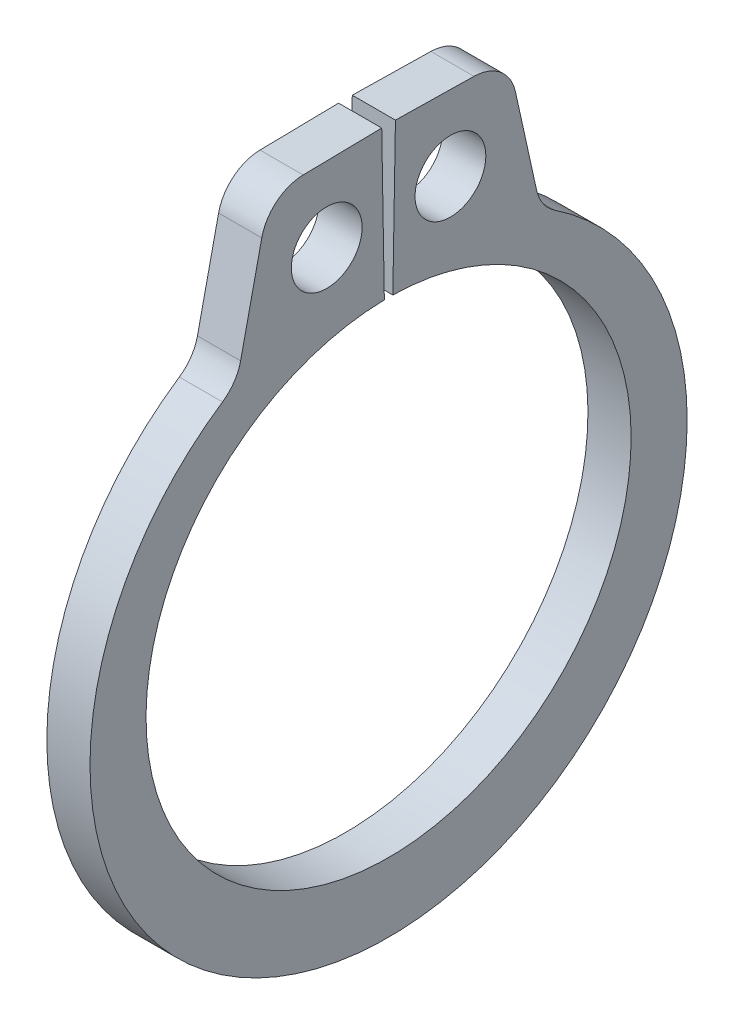
ISO-10303-21;
HEADER;
FILE_DESCRIPTION(('STEP AP214'),'2;1');
FILE_NAME('part.step','',(''),(''),'','','');
FILE_SCHEMA(('AUTOMOTIVE_DESIGN { 1 0 10303 214 1 1 1 1 }'));
ENDSEC;
DATA;
#1=APPLICATION_CONTEXT('core data for automotive mechanical design processes');
#2=APPLICATION_PROTOCOL_DEFINITION('international standard','automotive_design',2000,#1);
#3=PRODUCT_CONTEXT('',#1,'mechanical');
#4=PRODUCT('Part','Part','',(#3));
#5=PRODUCT_RELATED_PRODUCT_CATEGORY('part','',(#4));
#6=PRODUCT_DEFINITION_FORMATION('','',#4);
#7=PRODUCT_DEFINITION_CONTEXT('part definition',#1,'design');
#8=PRODUCT_DEFINITION('design','',#6,#7);
#9=PRODUCT_DEFINITION_SHAPE('','',#8);
#10=(LENGTH_UNIT() NAMED_UNIT(*) SI_UNIT(.MILLI.,.METRE.));
#11=(NAMED_UNIT(*) PLANE_ANGLE_UNIT() SI_UNIT($,.RADIAN.));
#12=(NAMED_UNIT(*) SI_UNIT($,.STERADIAN.) SOLID_ANGLE_UNIT());
#13=UNCERTAINTY_MEASURE_WITH_UNIT(LENGTH_MEASURE(1.E-05),#10,'distance_accuracy_value','');
#14=(GEOMETRIC_REPRESENTATION_CONTEXT(3) GLOBAL_UNCERTAINTY_ASSIGNED_CONTEXT((#13)) GLOBAL_UNIT_ASSIGNED_CONTEXT((#10,
#11,#12)) REPRESENTATION_CONTEXT('',''));
#15=CARTESIAN_POINT('',(0.,0.,0.));
#16=DIRECTION('',(0.,0.,1.));
#17=DIRECTION('',(1.,0.,0.));
#18=AXIS2_PLACEMENT_3D('',#15,#16,#17);
#19=CARTESIAN_POINT('',(0.3175,0.,0.));
#20=DIRECTION('',(1.,0.,0.));
#21=DIRECTION('',(0.,0.,-1.));
#22=AXIS2_PLACEMENT_3D('',#19,#20,#21);
#23=PLANE('',#22);
#24=CARTESIAN_POINT('',(0.3175,4.65842581517849,0.910114355509011));
#25=DIRECTION('',(1.,0.,0.));
#26=DIRECTION('',(0.,0.,-1.));
#27=AXIS2_PLACEMENT_3D('',#24,#25,#26);
#28=CIRCLE('',#27,0.5207);
#29=CARTESIAN_POINT('',(0.3175,4.65842581517849,0.38941435550901));
#30=VERTEX_POINT('',#29);
#31=EDGE_CURVE('E222',#30,#30,#28,.T.);
#32=ORIENTED_EDGE('',*,*,#31,.F.);
#33=EDGE_LOOP('',(#32));
#34=FACE_BOUND('',#33,.T.);
#35=DIRECTION('',(0.,-0.0174524064372835,0.999847695156391));
#36=VECTOR('',#35,1.);
#37=CARTESIAN_POINT('',(0.3175,5.77761990646121,0.100848730597843));
#38=LINE('',#37,#36);
#39=CARTESIAN_POINT('',(0.3175,5.77761990646121,0.100848730597843));
#40=VERTEX_POINT('',#39);
#41=CARTESIAN_POINT('',(0.3175,5.75744047202589,1.25692775512773));
#42=VERTEX_POINT('',#41);
#43=EDGE_CURVE('E134',#40,#42,#38,.T.);
#44=ORIENTED_EDGE('',*,*,#43,.T.);
#45=CARTESIAN_POINT('',(0.3175,5.12253718560158,1.24584547704006));
#46=DIRECTION('',(1.,0.,0.));
#47=DIRECTION('',(0.,0.,-1.));
#48=AXIS2_PLACEMENT_3D('',#45,#46,#47);
#49=CIRCLE('',#48,0.635);
#50=CARTESIAN_POINT('',(0.3175,5.25937291445874,1.86592690984395));
#51=VERTEX_POINT('',#50);
#52=EDGE_CURVE('E175',#42,#51,#49,.T.);
#53=ORIENTED_EDGE('',*,*,#52,.T.);
#54=DIRECTION('',(0.,-0.976506193391958,0.215489336782934));
#55=VECTOR('',#54,1.);
#56=CARTESIAN_POINT('',(0.3175,5.74869516065237,1.75794630816529));
#57=LINE('',#56,#55);
#58=CARTESIAN_POINT('',(0.3175,3.84966926127579,2.17701157816509));
#59=VERTEX_POINT('',#58);
#60=EDGE_CURVE('E214',#51,#59,#57,.T.);
#61=ORIENTED_EDGE('',*,*,#60,.T.);
#62=CARTESIAN_POINT('',(0.3175,3.98650499013295,2.79709301096898));
#63=DIRECTION('',(1.,0.,0.));
#64=DIRECTION('',(0.,0.,-1.));
#65=AXIS2_PLACEMENT_3D('',#62,#63,#64);
#66=CIRCLE('',#65,0.635);
#67=CARTESIAN_POINT('',(0.3175,3.45883224612625,2.44384171906414));
#68=VERTEX_POINT('',#67);
#69=EDGE_CURVE('E182',#59,#68,#66,.F.);
#70=ORIENTED_EDGE('',*,*,#69,.T.);
#71=CARTESIAN_POINT('',(0.3175,-0.191681411907309,0.));
#72=DIRECTION('',(1.,0.,0.));
#73=DIRECTION('',(0.,0.,-1.));
#74=AXIS2_PLACEMENT_3D('',#71,#72,#73);
#75=CIRCLE('',#74,4.39301858809269);
#76=CARTESIAN_POINT('',(0.3175,3.45883224612625,-2.44384171906414));
#77=VERTEX_POINT('',#76);
#78=EDGE_CURVE('E207',#68,#77,#75,.T.);
#79=ORIENTED_EDGE('',*,*,#78,.T.);
#80=CARTESIAN_POINT('',(0.3175,3.98650499013295,-2.79709301096898));
#81=DIRECTION('',(1.,0.,0.));
#82=DIRECTION('',(0.,0.,-1.));
#83=AXIS2_PLACEMENT_3D('',#80,#81,#82);
#84=CIRCLE('',#83,0.635);
#85=CARTESIAN_POINT('',(0.3175,3.84966926127579,-2.17701157816509));
#86=VERTEX_POINT('',#85);
#87=EDGE_CURVE('E11',#77,#86,#84,.F.);
#88=ORIENTED_EDGE('',*,*,#87,.T.);
#89=DIRECTION('',(0.,0.976506193391958,0.215489336782934));
#90=VECTOR('',#89,1.);
#91=CARTESIAN_POINT('',(0.3175,5.74869516065237,-1.75794630816529));
#92=LINE('',#91,#90);
#93=CARTESIAN_POINT('',(0.3175,5.25937291445874,-1.86592690984395));
#94=VERTEX_POINT('',#93);
#95=EDGE_CURVE('E206',#86,#94,#92,.T.);
#96=ORIENTED_EDGE('',*,*,#95,.T.);
#97=CARTESIAN_POINT('',(0.3175,5.12253718560158,-1.24584547704006));
#98=DIRECTION('',(1.,0.,0.));
#99=DIRECTION('',(0.,0.,-1.));
#100=AXIS2_PLACEMENT_3D('',#97,#98,#99);
#101=CIRCLE('',#100,0.635);
#102=CARTESIAN_POINT('',(0.3175,5.75744047202589,-1.25692775512773));
#103=VERTEX_POINT('',#102);
#104=EDGE_CURVE('E50',#94,#103,#101,.T.);
#105=ORIENTED_EDGE('',*,*,#104,.T.);
#106=DIRECTION('',(0.,0.017452406437284,0.999847695156391));
#107=VECTOR('',#106,1.);
#108=CARTESIAN_POINT('',(0.3175,5.77761990646121,-0.100848730597843));
#109=LINE('',#108,#107);
#110=CARTESIAN_POINT('',(0.3175,5.77761990646121,-0.100848730597843));
#111=VERTEX_POINT('',#110);
#112=EDGE_CURVE('E211',#103,#111,#109,.T.);
#113=ORIENTED_EDGE('',*,*,#112,.T.);
#114=DIRECTION('',(0.,-0.999847695156391,0.0174524064372835));
#115=VECTOR('',#114,1.);
#116=CARTESIAN_POINT('',(0.3175,3.56815646970461,-0.0622824028527338));
#117=LINE('',#116,#115);
#118=CARTESIAN_POINT('',(0.3175,3.56815646970461,-0.0622824028527338));
#119=VERTEX_POINT('',#118);
#120=EDGE_CURVE('E140',#111,#119,#117,.T.);
#121=ORIENTED_EDGE('',*,*,#120,.T.);
#122=CARTESIAN_POINT('',(0.3175,0.,0.));
#123=DIRECTION('',(-1.,0.,0.));
#124=DIRECTION('',(0.,0.,-1.));
#125=AXIS2_PLACEMENT_3D('',#122,#123,#124);
#126=CIRCLE('',#125,3.5687);
#127=CARTESIAN_POINT('',(0.3175,3.56815646970461,0.0622824028527338));
#128=VERTEX_POINT('',#127);
#129=EDGE_CURVE('E135',#119,#128,#126,.T.);
#130=ORIENTED_EDGE('',*,*,#129,.T.);
#131=DIRECTION('',(0.,0.999847695156391,0.0174524064372835));
#132=VECTOR('',#131,1.);
#133=CARTESIAN_POINT('',(0.3175,3.56815646970461,0.0622824028527338));
#134=LINE('',#133,#132);
#135=EDGE_CURVE('E126',#128,#40,#134,.T.);
#136=ORIENTED_EDGE('',*,*,#135,.T.);
#137=EDGE_LOOP('',(#44,#53,#61,#70,#79,#88,#96,#105,#113,#121,#130,#136));
#138=FACE_BOUND('',#137,.T.);
#139=CARTESIAN_POINT('',(0.3175,4.65842581517849,-0.910114355509011));
#140=DIRECTION('',(1.,0.,0.));
#141=DIRECTION('',(0.,0.,-1.));
#142=AXIS2_PLACEMENT_3D('',#139,#140,#141);
#143=CIRCLE('',#142,0.5207);
#144=CARTESIAN_POINT('',(0.3175,4.65842581517849,-1.43081435550901));
#145=VERTEX_POINT('',#144);
#146=EDGE_CURVE('E248',#145,#145,#143,.T.);
#147=ORIENTED_EDGE('',*,*,#146,.F.);
#148=EDGE_LOOP('',(#147));
#149=FACE_BOUND('',#148,.T.);
#150=ADVANCED_FACE('F35',(#34,#138,#149),#23,.T.);
#151=CARTESIAN_POINT('',(-0.3175,0.,0.));
#152=DIRECTION('',(1.,0.,0.));
#153=DIRECTION('',(0.,0.,-1.));
#154=AXIS2_PLACEMENT_3D('',#151,#152,#153);
#155=PLANE('',#154);
#156=CARTESIAN_POINT('',(-0.3175,4.65842581517849,0.910114355509011));
#157=DIRECTION('',(1.,0.,0.));
#158=DIRECTION('',(0.,0.,-1.));
#159=AXIS2_PLACEMENT_3D('',#156,#157,#158);
#160=CIRCLE('',#159,0.5207);
#161=CARTESIAN_POINT('',(-0.3175,4.65842581517849,0.38941435550901));
#162=VERTEX_POINT('',#161);
#163=EDGE_CURVE('E245',#162,#162,#160,.T.);
#164=ORIENTED_EDGE('',*,*,#163,.T.);
#165=EDGE_LOOP('',(#164));
#166=FACE_BOUND('',#165,.T.);
#167=DIRECTION('',(0.,-0.976506193391958,0.215489336782934));
#168=VECTOR('',#167,1.);
#169=CARTESIAN_POINT('',(-0.3175,5.74869516065237,1.75794630816529));
#170=LINE('',#169,#168);
#171=CARTESIAN_POINT('',(-0.3175,5.25937291445874,1.86592690984395));
#172=VERTEX_POINT('',#171);
#173=CARTESIAN_POINT('',(-0.3175,3.84966926127579,2.17701157816509));
#174=VERTEX_POINT('',#173);
#175=EDGE_CURVE('E201',#172,#174,#170,.T.);
#176=ORIENTED_EDGE('',*,*,#175,.F.);
#177=CARTESIAN_POINT('',(-0.3175,5.12253718560158,1.24584547704006));
#178=DIRECTION('',(1.,0.,0.));
#179=DIRECTION('',(0.,0.,-1.));
#180=AXIS2_PLACEMENT_3D('',#177,#178,#179);
#181=CIRCLE('',#180,0.635);
#182=CARTESIAN_POINT('',(-0.3175,5.75744047202589,1.25692775512773));
#183=VERTEX_POINT('',#182);
#184=EDGE_CURVE('E171',#172,#183,#181,.F.);
#185=ORIENTED_EDGE('',*,*,#184,.T.);
#186=DIRECTION('',(0.,-0.0174524064372835,0.999847695156391));
#187=VECTOR('',#186,1.);
#188=CARTESIAN_POINT('',(-0.3175,5.77761990646121,0.100848730597843));
#189=LINE('',#188,#187);
#190=CARTESIAN_POINT('',(-0.3175,5.77761990646121,0.100848730597843));
#191=VERTEX_POINT('',#190);
#192=EDGE_CURVE('E224',#191,#183,#189,.T.);
#193=ORIENTED_EDGE('',*,*,#192,.F.);
#194=DIRECTION('',(0.,0.999847695156391,0.0174524064372835));
#195=VECTOR('',#194,1.);
#196=CARTESIAN_POINT('',(-0.3175,3.56815646970461,0.0622824028527338));
#197=LINE('',#196,#195);
#198=CARTESIAN_POINT('',(-0.3175,3.56815646970461,0.0622824028527338));
#199=VERTEX_POINT('',#198);
#200=EDGE_CURVE('E221',#199,#191,#197,.T.);
#201=ORIENTED_EDGE('',*,*,#200,.F.);
#202=CARTESIAN_POINT('',(-0.3175,0.,0.));
#203=DIRECTION('',(-1.,0.,0.));
#204=DIRECTION('',(0.,0.,-1.));
#205=AXIS2_PLACEMENT_3D('',#202,#203,#204);
#206=CIRCLE('',#205,3.5687);
#207=CARTESIAN_POINT('',(-0.3175,3.56815646970461,-0.0622824028527338));
#208=VERTEX_POINT('',#207);
#209=EDGE_CURVE('E148',#208,#199,#206,.T.);
#210=ORIENTED_EDGE('',*,*,#209,.F.);
#211=DIRECTION('',(0.,-0.999847695156391,0.0174524064372835));
#212=VECTOR('',#211,1.);
#213=CARTESIAN_POINT('',(-0.3175,3.56815646970461,-0.0622824028527338));
#214=LINE('',#213,#212);
#215=CARTESIAN_POINT('',(-0.3175,5.77761990646121,-0.100848730597843));
#216=VERTEX_POINT('',#215);
#217=EDGE_CURVE('E144',#216,#208,#214,.T.);
#218=ORIENTED_EDGE('',*,*,#217,.F.);
#219=DIRECTION('',(0.,0.017452406437284,0.999847695156391));
#220=VECTOR('',#219,1.);
#221=CARTESIAN_POINT('',(-0.3175,5.77761990646121,-0.100848730597843));
#222=LINE('',#221,#220);
#223=CARTESIAN_POINT('',(-0.3175,5.75744047202589,-1.25692775512773));
#224=VERTEX_POINT('',#223);
#225=EDGE_CURVE('E229',#224,#216,#222,.T.);
#226=ORIENTED_EDGE('',*,*,#225,.F.);
#227=CARTESIAN_POINT('',(-0.3175,5.12253718560158,-1.24584547704006));
#228=DIRECTION('',(1.,0.,0.));
#229=DIRECTION('',(0.,0.,-1.));
#230=AXIS2_PLACEMENT_3D('',#227,#228,#229);
#231=CIRCLE('',#230,0.635);
#232=CARTESIAN_POINT('',(-0.3175,5.25937291445874,-1.86592690984395));
#233=VERTEX_POINT('',#232);
#234=EDGE_CURVE('E169',#224,#233,#231,.F.);
#235=ORIENTED_EDGE('',*,*,#234,.T.);
#236=DIRECTION('',(0.,0.976506193391958,0.215489336782934));
#237=VECTOR('',#236,1.);
#238=CARTESIAN_POINT('',(-0.3175,5.74869516065237,-1.75794630816529));
#239=LINE('',#238,#237);
#240=CARTESIAN_POINT('',(-0.3175,3.84966926127579,-2.17701157816509));
#241=VERTEX_POINT('',#240);
#242=EDGE_CURVE('E192',#241,#233,#239,.T.);
#243=ORIENTED_EDGE('',*,*,#242,.F.);
#244=CARTESIAN_POINT('',(-0.3175,3.98650499013295,-2.79709301096898));
#245=DIRECTION('',(1.,0.,0.));
#246=DIRECTION('',(0.,0.,-1.));
#247=AXIS2_PLACEMENT_3D('',#244,#245,#246);
#248=CIRCLE('',#247,0.635);
#249=CARTESIAN_POINT('',(-0.3175,3.45883224612625,-2.44384171906414));
#250=VERTEX_POINT('',#249);
#251=EDGE_CURVE('E43',#241,#250,#248,.T.);
#252=ORIENTED_EDGE('',*,*,#251,.T.);
#253=CARTESIAN_POINT('',(-0.3175,-0.191681411907309,0.));
#254=DIRECTION('',(1.,0.,0.));
#255=DIRECTION('',(0.,0.,-1.));
#256=AXIS2_PLACEMENT_3D('',#253,#254,#255);
#257=CIRCLE('',#256,4.39301858809269);
#258=CARTESIAN_POINT('',(-0.3175,3.45883224612625,2.44384171906414));
#259=VERTEX_POINT('',#258);
#260=EDGE_CURVE('E190',#259,#250,#257,.T.);
#261=ORIENTED_EDGE('',*,*,#260,.F.);
#262=CARTESIAN_POINT('',(-0.3175,3.98650499013295,2.79709301096898));
#263=DIRECTION('',(1.,0.,0.));
#264=DIRECTION('',(0.,0.,-1.));
#265=AXIS2_PLACEMENT_3D('',#262,#263,#264);
#266=CIRCLE('',#265,0.635);
#267=EDGE_CURVE('E180',#259,#174,#266,.T.);
#268=ORIENTED_EDGE('',*,*,#267,.T.);
#269=EDGE_LOOP('',(#176,#185,#193,#201,#210,#218,#226,#235,#243,#252,#261,#268));
#270=FACE_BOUND('',#269,.T.);
#271=CARTESIAN_POINT('',(-0.3175,4.65842581517849,-0.910114355509011));
#272=DIRECTION('',(1.,0.,0.));
#273=DIRECTION('',(0.,0.,-1.));
#274=AXIS2_PLACEMENT_3D('',#271,#272,#273);
#275=CIRCLE('',#274,0.5207);
#276=CARTESIAN_POINT('',(-0.3175,4.65842581517849,-1.43081435550901));
#277=VERTEX_POINT('',#276);
#278=EDGE_CURVE('E251',#277,#277,#275,.T.);
#279=ORIENTED_EDGE('',*,*,#278,.T.);
#280=EDGE_LOOP('',(#279));
#281=FACE_BOUND('',#280,.T.);
#282=ADVANCED_FACE('F188',(#166,#270,#281),#155,.F.);
#283=CARTESIAN_POINT('',(0.3175,0.,0.));
#284=DIRECTION('',(-1.,0.,0.));
#285=DIRECTION('',(0.,0.,1.));
#286=AXIS2_PLACEMENT_3D('',#283,#284,#285);
#287=CYLINDRICAL_SURFACE('',#286,3.5687);
#288=ORIENTED_EDGE('',*,*,#209,.T.);
#289=DIRECTION('',(-1.,0.,0.));
#290=VECTOR('',#289,1.);
#291=CARTESIAN_POINT('',(0.3175,3.56815646970461,0.0622824028527338));
#292=LINE('',#291,#290);
#293=EDGE_CURVE('E130',#128,#199,#292,.T.);
#294=ORIENTED_EDGE('',*,*,#293,.F.);
#295=ORIENTED_EDGE('',*,*,#129,.F.);
#296=DIRECTION('',(-1.,0.,0.));
#297=VECTOR('',#296,1.);
#298=CARTESIAN_POINT('',(0.3175,3.56815646970461,-0.0622824028527338));
#299=LINE('',#298,#297);
#300=EDGE_CURVE('E219',#119,#208,#299,.T.);
#301=ORIENTED_EDGE('',*,*,#300,.T.);
#302=EDGE_LOOP('',(#288,#294,#295,#301));
#303=FACE_BOUND('',#302,.T.);
#304=ADVANCED_FACE('F146',(#303),#287,.F.);
#305=CARTESIAN_POINT('',(0.3175,3.56815646970461,0.0622824028527338));
#306=DIRECTION('',(0.,-0.0174524064372835,0.999847695156391));
#307=DIRECTION('',(0.,-0.999847695156391,-0.0174524064372835));
#308=AXIS2_PLACEMENT_3D('',#305,#306,#307);
#309=PLANE('',#308);
#310=ORIENTED_EDGE('',*,*,#200,.T.);
#311=DIRECTION('',(-1.,0.,0.));
#312=VECTOR('',#311,1.);
#313=CARTESIAN_POINT('',(0.3175,5.77761990646121,0.100848730597843));
#314=LINE('',#313,#312);
#315=EDGE_CURVE('E133',#40,#191,#314,.T.);
#316=ORIENTED_EDGE('',*,*,#315,.F.);
#317=ORIENTED_EDGE('',*,*,#135,.F.);
#318=ORIENTED_EDGE('',*,*,#293,.T.);
#319=EDGE_LOOP('',(#310,#316,#317,#318));
#320=FACE_BOUND('',#319,.T.);
#321=ADVANCED_FACE('F128',(#320),#309,.F.);
#322=CARTESIAN_POINT('',(0.3175,5.77761990646121,0.100848730597843));
#323=DIRECTION('',(0.,-0.999847695156391,-0.0174524064372835));
#324=DIRECTION('',(0.,0.0174524064372835,-0.999847695156391));
#325=AXIS2_PLACEMENT_3D('',#322,#323,#324);
#326=PLANE('',#325);
#327=ORIENTED_EDGE('',*,*,#192,.T.);
#328=DIRECTION('',(-1.,0.,0.));
#329=VECTOR('',#328,1.);
#330=CARTESIAN_POINT('',(0.3175,5.75744047202589,1.25692775512773));
#331=LINE('',#330,#329);
#332=EDGE_CURVE('E58',#183,#42,#331,.F.);
#333=ORIENTED_EDGE('',*,*,#332,.T.);
#334=ORIENTED_EDGE('',*,*,#43,.F.);
#335=ORIENTED_EDGE('',*,*,#315,.T.);
#336=EDGE_LOOP('',(#327,#333,#334,#335));
#337=FACE_BOUND('',#336,.T.);
#338=ADVANCED_FACE('F240',(#337),#326,.F.);
#339=CARTESIAN_POINT('',(0.3175,5.74869516065237,1.75794630816529));
#340=DIRECTION('',(0.,-0.215489336782934,-0.976506193391957));
#341=DIRECTION('',(0.,0.976506193391958,-0.215489336782934));
#342=AXIS2_PLACEMENT_3D('',#339,#340,#341);
#343=PLANE('',#342);
#344=ORIENTED_EDGE('',*,*,#175,.T.);
#345=DIRECTION('',(1.,0.,0.));
#346=VECTOR('',#345,1.);
#347=CARTESIAN_POINT('',(0.3175,3.84966926127579,2.17701157816509));
#348=LINE('',#347,#346);
#349=EDGE_CURVE('E162',#174,#59,#348,.T.);
#350=ORIENTED_EDGE('',*,*,#349,.T.);
#351=ORIENTED_EDGE('',*,*,#60,.F.);
#352=DIRECTION('',(-1.,0.,0.));
#353=VECTOR('',#352,1.);
#354=CARTESIAN_POINT('',(0.3175,5.25937291445874,1.86592690984395));
#355=LINE('',#354,#353);
#356=EDGE_CURVE('E159',#51,#172,#355,.T.);
#357=ORIENTED_EDGE('',*,*,#356,.T.);
#358=EDGE_LOOP('',(#344,#350,#351,#357));
#359=FACE_BOUND('',#358,.T.);
#360=ADVANCED_FACE('F281',(#359),#343,.F.);
#361=CARTESIAN_POINT('',(0.3175,-0.191681411907309,0.));
#362=DIRECTION('',(-1.,0.,0.));
#363=DIRECTION('',(0.,0.,1.));
#364=AXIS2_PLACEMENT_3D('',#361,#362,#363);
#365=CYLINDRICAL_SURFACE('',#364,4.39301858809269);
#366=ORIENTED_EDGE('',*,*,#78,.F.);
#367=DIRECTION('',(-1.,0.,0.));
#368=VECTOR('',#367,1.);
#369=CARTESIAN_POINT('',(0.3175,3.45883224612625,2.44384171906414));
#370=LINE('',#369,#368);
#371=EDGE_CURVE('E151',#68,#259,#370,.T.);
#372=ORIENTED_EDGE('',*,*,#371,.T.);
#373=ORIENTED_EDGE('',*,*,#260,.T.);
#374=DIRECTION('',(-1.,0.,0.));
#375=VECTOR('',#374,1.);
#376=CARTESIAN_POINT('',(0.3175,3.45883224612625,-2.44384171906414));
#377=LINE('',#376,#375);
#378=EDGE_CURVE('E149',#250,#77,#377,.F.);
#379=ORIENTED_EDGE('',*,*,#378,.T.);
#380=EDGE_LOOP('',(#366,#372,#373,#379));
#381=FACE_BOUND('',#380,.T.);
#382=ADVANCED_FACE('F198',(#381),#365,.T.);
#383=CARTESIAN_POINT('',(0.3175,5.74869516065237,-1.75794630816529));
#384=DIRECTION('',(0.,-0.215489336782934,0.976506193391957));
#385=DIRECTION('',(0.,-0.976506193391958,-0.215489336782934));
#386=AXIS2_PLACEMENT_3D('',#383,#384,#385);
#387=PLANE('',#386);
#388=ORIENTED_EDGE('',*,*,#95,.F.);
#389=DIRECTION('',(1.,0.,0.));
#390=VECTOR('',#389,1.);
#391=CARTESIAN_POINT('',(-0.3175,3.84966926127579,-2.17701157816509));
#392=LINE('',#391,#390);
#393=EDGE_CURVE('E166',#86,#241,#392,.F.);
#394=ORIENTED_EDGE('',*,*,#393,.T.);
#395=ORIENTED_EDGE('',*,*,#242,.T.);
#396=DIRECTION('',(-1.,0.,0.));
#397=VECTOR('',#396,1.);
#398=CARTESIAN_POINT('',(0.3175,5.25937291445874,-1.86592690984395));
#399=LINE('',#398,#397);
#400=EDGE_CURVE('E164',#233,#94,#399,.F.);
#401=ORIENTED_EDGE('',*,*,#400,.T.);
#402=EDGE_LOOP('',(#388,#394,#395,#401));
#403=FACE_BOUND('',#402,.T.);
#404=ADVANCED_FACE('F209',(#403),#387,.F.);
#405=CARTESIAN_POINT('',(0.3175,5.77761990646121,-0.100848730597843));
#406=DIRECTION('',(0.,-0.999847695156391,0.017452406437284));
#407=DIRECTION('',(0.,-0.017452406437284,-0.999847695156391));
#408=AXIS2_PLACEMENT_3D('',#405,#406,#407);
#409=PLANE('',#408);
#410=ORIENTED_EDGE('',*,*,#112,.F.);
#411=DIRECTION('',(-1.,0.,0.));
#412=VECTOR('',#411,1.);
#413=CARTESIAN_POINT('',(0.3175,5.75744047202589,-1.25692775512773));
#414=LINE('',#413,#412);
#415=EDGE_CURVE('E177',#103,#224,#414,.T.);
#416=ORIENTED_EDGE('',*,*,#415,.T.);
#417=ORIENTED_EDGE('',*,*,#225,.T.);
#418=DIRECTION('',(-1.,0.,0.));
#419=VECTOR('',#418,1.);
#420=CARTESIAN_POINT('',(0.3175,5.77761990646121,-0.100848730597843));
#421=LINE('',#420,#419);
#422=EDGE_CURVE('E153',#111,#216,#421,.T.);
#423=ORIENTED_EDGE('',*,*,#422,.F.);
#424=EDGE_LOOP('',(#410,#416,#417,#423));
#425=FACE_BOUND('',#424,.T.);
#426=ADVANCED_FACE('F274',(#425),#409,.F.);
#427=CARTESIAN_POINT('',(0.3175,3.56815646970461,-0.0622824028527338));
#428=DIRECTION('',(0.,-0.0174524064372835,-0.999847695156391));
#429=DIRECTION('',(0.,0.999847695156391,-0.0174524064372835));
#430=AXIS2_PLACEMENT_3D('',#427,#428,#429);
#431=PLANE('',#430);
#432=ORIENTED_EDGE('',*,*,#217,.T.);
#433=ORIENTED_EDGE('',*,*,#300,.F.);
#434=ORIENTED_EDGE('',*,*,#120,.F.);
#435=ORIENTED_EDGE('',*,*,#422,.T.);
#436=EDGE_LOOP('',(#432,#433,#434,#435));
#437=FACE_BOUND('',#436,.T.);
#438=ADVANCED_FACE('F236',(#437),#431,.F.);
#439=CARTESIAN_POINT('',(0.3175,4.65842581517849,0.910114355509011));
#440=DIRECTION('',(-1.,0.,0.));
#441=DIRECTION('',(0.,0.,1.));
#442=AXIS2_PLACEMENT_3D('',#439,#440,#441);
#443=CYLINDRICAL_SURFACE('',#442,0.5207);
#444=ORIENTED_EDGE('',*,*,#31,.T.);
#445=EDGE_LOOP('',(#444));
#446=FACE_BOUND('',#445,.T.);
#447=ORIENTED_EDGE('',*,*,#163,.F.);
#448=EDGE_LOOP('',(#447));
#449=FACE_BOUND('',#448,.T.);
#450=ADVANCED_FACE('F269',(#446,#449),#443,.F.);
#451=CARTESIAN_POINT('',(0.3175,4.65842581517849,-0.910114355509011));
#452=DIRECTION('',(-1.,0.,0.));
#453=DIRECTION('',(0.,0.,1.));
#454=AXIS2_PLACEMENT_3D('',#451,#452,#453);
#455=CYLINDRICAL_SURFACE('',#454,0.5207);
#456=ORIENTED_EDGE('',*,*,#146,.T.);
#457=EDGE_LOOP('',(#456));
#458=FACE_BOUND('',#457,.T.);
#459=ORIENTED_EDGE('',*,*,#278,.F.);
#460=EDGE_LOOP('',(#459));
#461=FACE_BOUND('',#460,.T.);
#462=ADVANCED_FACE('F257',(#458,#461),#455,.F.);
#463=CARTESIAN_POINT('',(0.3175,3.98650499013295,2.79709301096898));
#464=DIRECTION('',(-1.,0.,0.));
#465=DIRECTION('',(0.,0.,1.));
#466=AXIS2_PLACEMENT_3D('',#463,#464,#465);
#467=CYLINDRICAL_SURFACE('',#466,0.635);
#468=ORIENTED_EDGE('',*,*,#69,.F.);
#469=ORIENTED_EDGE('',*,*,#349,.F.);
#470=ORIENTED_EDGE('',*,*,#267,.F.);
#471=ORIENTED_EDGE('',*,*,#371,.F.);
#472=EDGE_LOOP('',(#468,#469,#470,#471));
#473=FACE_BOUND('',#472,.T.);
#474=ADVANCED_FACE('F291',(#473),#467,.F.);
#475=CARTESIAN_POINT('',(0.3175,3.98650499013295,-2.79709301096898));
#476=DIRECTION('',(-1.,0.,0.));
#477=DIRECTION('',(0.,0.,1.));
#478=AXIS2_PLACEMENT_3D('',#475,#476,#477);
#479=CYLINDRICAL_SURFACE('',#478,0.635);
#480=ORIENTED_EDGE('',*,*,#87,.F.);
#481=ORIENTED_EDGE('',*,*,#378,.F.);
#482=ORIENTED_EDGE('',*,*,#251,.F.);
#483=ORIENTED_EDGE('',*,*,#393,.F.);
#484=EDGE_LOOP('',(#480,#481,#482,#483));
#485=FACE_BOUND('',#484,.T.);
#486=ADVANCED_FACE('F204',(#485),#479,.F.);
#487=CARTESIAN_POINT('',(0.3175,5.12253718560158,1.24584547704006));
#488=DIRECTION('',(-1.,0.,0.));
#489=DIRECTION('',(0.,0.,1.));
#490=AXIS2_PLACEMENT_3D('',#487,#488,#489);
#491=CYLINDRICAL_SURFACE('',#490,0.635);
#492=ORIENTED_EDGE('',*,*,#52,.F.);
#493=ORIENTED_EDGE('',*,*,#332,.F.);
#494=ORIENTED_EDGE('',*,*,#184,.F.);
#495=ORIENTED_EDGE('',*,*,#356,.F.);
#496=EDGE_LOOP('',(#492,#493,#494,#495));
#497=FACE_BOUND('',#496,.T.);
#498=ADVANCED_FACE('F296',(#497),#491,.T.);
#499=CARTESIAN_POINT('',(0.3175,5.12253718560158,-1.24584547704006));
#500=DIRECTION('',(-1.,0.,0.));
#501=DIRECTION('',(0.,0.,1.));
#502=AXIS2_PLACEMENT_3D('',#499,#500,#501);
#503=CYLINDRICAL_SURFACE('',#502,0.635);
#504=ORIENTED_EDGE('',*,*,#104,.F.);
#505=ORIENTED_EDGE('',*,*,#400,.F.);
#506=ORIENTED_EDGE('',*,*,#234,.F.);
#507=ORIENTED_EDGE('',*,*,#415,.F.);
#508=EDGE_LOOP('',(#504,#505,#506,#507));
#509=FACE_BOUND('',#508,.T.);
#510=ADVANCED_FACE('F37',(#509),#503,.T.);
#511=CLOSED_SHELL('',(#150,#282,#304,#321,#338,#360,#382,#404,#426,#438,#450,#462,#474,#486,
#498,#510));
#512=MANIFOLD_SOLID_BREP('B2',#511);
#513=ADVANCED_BREP_SHAPE_REPRESENTATION('',(#18,#512),#14);
#514=SHAPE_DEFINITION_REPRESENTATION(#9,#513);
ENDSEC;
END-ISO-10303-21;
